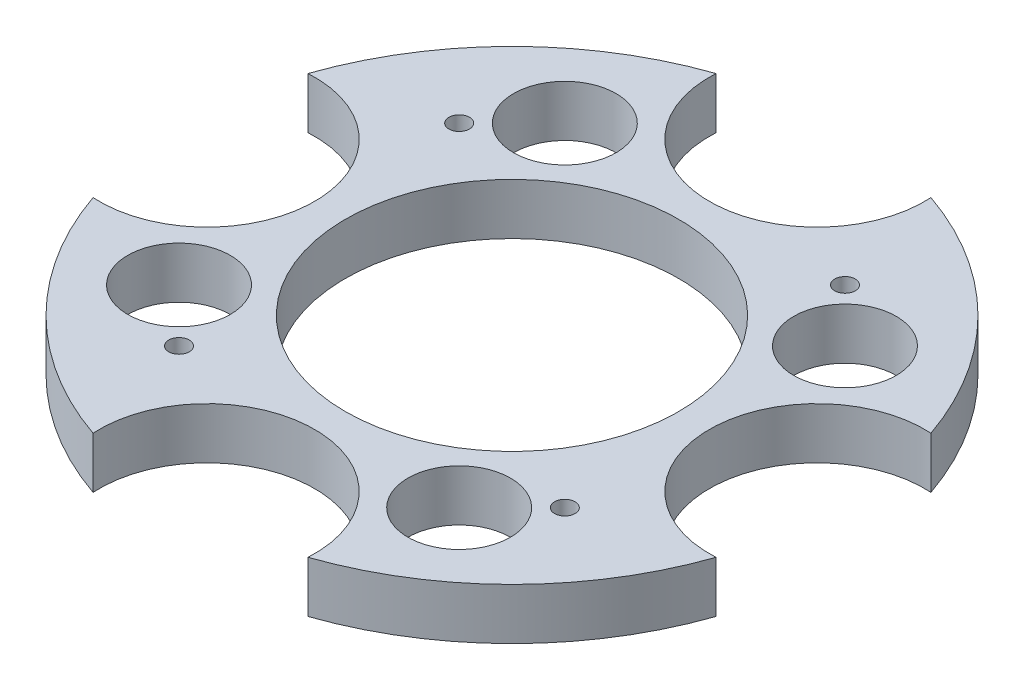
ISO-10303-21;
HEADER;
FILE_DESCRIPTION(('STEP AP214'),'2;1');
FILE_NAME('part.step','',(''),(''),'','','');
FILE_SCHEMA(('AUTOMOTIVE_DESIGN { 1 0 10303 214 1 1 1 1 }'));
ENDSEC;
DATA;
#1=APPLICATION_CONTEXT('core data for automotive mechanical design processes');
#2=APPLICATION_PROTOCOL_DEFINITION('international standard','automotive_design',2000,#1);
#3=PRODUCT_CONTEXT('',#1,'mechanical');
#4=PRODUCT('Part','Part','',(#3));
#5=PRODUCT_RELATED_PRODUCT_CATEGORY('part','',(#4));
#6=PRODUCT_DEFINITION_FORMATION('','',#4);
#7=PRODUCT_DEFINITION_CONTEXT('part definition',#1,'design');
#8=PRODUCT_DEFINITION('design','',#6,#7);
#9=PRODUCT_DEFINITION_SHAPE('','',#8);
#10=(LENGTH_UNIT() NAMED_UNIT(*) SI_UNIT(.MILLI.,.METRE.));
#11=(NAMED_UNIT(*) PLANE_ANGLE_UNIT() SI_UNIT($,.RADIAN.));
#12=(NAMED_UNIT(*) SI_UNIT($,.STERADIAN.) SOLID_ANGLE_UNIT());
#13=UNCERTAINTY_MEASURE_WITH_UNIT(LENGTH_MEASURE(1.E-05),#10,'distance_accuracy_value','');
#14=(GEOMETRIC_REPRESENTATION_CONTEXT(3) GLOBAL_UNCERTAINTY_ASSIGNED_CONTEXT((#13)) GLOBAL_UNIT_ASSIGNED_CONTEXT((#10,
#11,#12)) REPRESENTATION_CONTEXT('',''));
#15=CARTESIAN_POINT('',(0.,0.,0.));
#16=DIRECTION('',(0.,0.,1.));
#17=DIRECTION('',(1.,0.,0.));
#18=AXIS2_PLACEMENT_3D('',#15,#16,#17);
#19=CARTESIAN_POINT('',(0.,2.5,0.));
#20=DIRECTION('',(0.,1.,0.));
#21=DIRECTION('',(0.,0.,1.));
#22=AXIS2_PLACEMENT_3D('',#19,#20,#21);
#23=PLANE('',#22);
#24=CARTESIAN_POINT('',(18.8130252100839,2.5,-13.6613536095347));
#25=DIRECTION('',(0.,1.,0.));
#26=DIRECTION('',(-1.,0.,0.));
#27=AXIS2_PLACEMENT_3D('',#24,#25,#26);
#28=CIRCLE('',#27,5.);
#29=CARTESIAN_POINT('',(13.8130252100839,2.5,-13.6613536095347));
#30=VERTEX_POINT('',#29);
#31=EDGE_CURVE('E174',#30,#30,#28,.T.);
#32=ORIENTED_EDGE('',*,*,#31,.F.);
#33=EDGE_LOOP('',(#32));
#34=FACE_BOUND('',#33,.T.);
#35=CARTESIAN_POINT('',(-13.6613536095346,2.5,18.813025210084));
#36=DIRECTION('',(0.,1.,0.));
#37=DIRECTION('',(0.,0.,-1.));
#38=AXIS2_PLACEMENT_3D('',#35,#36,#37);
#39=CIRCLE('',#38,1.);
#40=CARTESIAN_POINT('',(-13.6613536095346,2.5,17.813025210084));
#41=VERTEX_POINT('',#40);
#42=EDGE_CURVE('E178',#41,#41,#39,.T.);
#43=ORIENTED_EDGE('',*,*,#42,.F.);
#44=EDGE_LOOP('',(#43));
#45=FACE_BOUND('',#44,.T.);
#46=CARTESIAN_POINT('',(13.6613536095345,2.5,18.813025210084));
#47=DIRECTION('',(0.,1.,0.));
#48=DIRECTION('',(0.,0.,-1.));
#49=AXIS2_PLACEMENT_3D('',#46,#47,#48);
#50=CIRCLE('',#49,5.);
#51=CARTESIAN_POINT('',(13.6613536095345,2.5,13.813025210084));
#52=VERTEX_POINT('',#51);
#53=EDGE_CURVE('E182',#52,#52,#50,.T.);
#54=ORIENTED_EDGE('',*,*,#53,.F.);
#55=EDGE_LOOP('',(#54));
#56=FACE_BOUND('',#55,.T.);
#57=CARTESIAN_POINT('',(-18.8130252100841,2.5,-13.6613536095345));
#58=DIRECTION('',(0.,1.,0.));
#59=DIRECTION('',(1.,0.,0.));
#60=AXIS2_PLACEMENT_3D('',#57,#58,#59);
#61=CIRCLE('',#60,1.);
#62=CARTESIAN_POINT('',(-17.8130252100841,2.5,-13.6613536095345));
#63=VERTEX_POINT('',#62);
#64=EDGE_CURVE('E186',#63,#63,#61,.T.);
#65=ORIENTED_EDGE('',*,*,#64,.F.);
#66=EDGE_LOOP('',(#65));
#67=FACE_BOUND('',#66,.T.);
#68=CARTESIAN_POINT('',(18.8130252100842,2.5,13.6613536095344));
#69=DIRECTION('',(0.,1.,0.));
#70=DIRECTION('',(-1.,0.,0.));
#71=AXIS2_PLACEMENT_3D('',#68,#69,#70);
#72=CIRCLE('',#71,1.);
#73=CARTESIAN_POINT('',(17.8130252100842,2.5,13.6613536095344));
#74=VERTEX_POINT('',#73);
#75=EDGE_CURVE('E190',#74,#74,#72,.T.);
#76=ORIENTED_EDGE('',*,*,#75,.F.);
#77=EDGE_LOOP('',(#76));
#78=FACE_BOUND('',#77,.T.);
#79=CARTESIAN_POINT('',(-18.813025210084,2.5,13.6613536095346));
#80=DIRECTION('',(0.,1.,0.));
#81=DIRECTION('',(1.,0.,0.));
#82=AXIS2_PLACEMENT_3D('',#79,#80,#81);
#83=CIRCLE('',#82,5.);
#84=CARTESIAN_POINT('',(-13.813025210084,2.5,13.6613536095346));
#85=VERTEX_POINT('',#84);
#86=EDGE_CURVE('E194',#85,#85,#83,.T.);
#87=ORIENTED_EDGE('',*,*,#86,.F.);
#88=EDGE_LOOP('',(#87));
#89=FACE_BOUND('',#88,.T.);
#90=CARTESIAN_POINT('',(-13.6613536095345,2.5,-18.813025210084));
#91=DIRECTION('',(0.,1.,0.));
#92=DIRECTION('',(0.,0.,1.));
#93=AXIS2_PLACEMENT_3D('',#90,#91,#92);
#94=CIRCLE('',#93,5.);
#95=CARTESIAN_POINT('',(-13.6613536095345,2.5,-13.813025210084));
#96=VERTEX_POINT('',#95);
#97=EDGE_CURVE('E198',#96,#96,#94,.T.);
#98=ORIENTED_EDGE('',*,*,#97,.F.);
#99=EDGE_LOOP('',(#98));
#100=FACE_BOUND('',#99,.T.);
#101=CARTESIAN_POINT('',(13.6613536095346,2.5,-18.813025210084));
#102=DIRECTION('',(0.,1.,0.));
#103=DIRECTION('',(0.,0.,1.));
#104=AXIS2_PLACEMENT_3D('',#101,#102,#103);
#105=CIRCLE('',#104,1.);
#106=CARTESIAN_POINT('',(13.6613536095346,2.5,-17.813025210084));
#107=VERTEX_POINT('',#106);
#108=EDGE_CURVE('E202',#107,#107,#105,.T.);
#109=ORIENTED_EDGE('',*,*,#108,.F.);
#110=EDGE_LOOP('',(#109));
#111=FACE_BOUND('',#110,.T.);
#112=CARTESIAN_POINT('',(0.,2.5,0.));
#113=DIRECTION('',(0.,1.,0.));
#114=DIRECTION('',(0.,0.,1.));
#115=AXIS2_PLACEMENT_3D('',#112,#113,#114);
#116=CIRCLE('',#115,16.25);
#117=CARTESIAN_POINT('',(0.,2.5,16.25));
#118=VERTEX_POINT('',#117);
#119=EDGE_CURVE('E141',#118,#118,#116,.T.);
#120=ORIENTED_EDGE('',*,*,#119,.F.);
#121=EDGE_LOOP('',(#120));
#122=FACE_BOUND('',#121,.T.);
#123=CARTESIAN_POINT('',(0.,2.5,29.75));
#124=DIRECTION('',(0.,1.,0.));
#125=DIRECTION('',(0.,0.,-1.));
#126=AXIS2_PLACEMENT_3D('',#123,#124,#125);
#127=CIRCLE('',#126,10.5);
#128=CARTESIAN_POINT('',(10.4812233958542,2.5,30.3776592436975));
#129=VERTEX_POINT('',#128);
#130=CARTESIAN_POINT('',(-10.4812233958542,2.5,30.3776592436975));
#131=VERTEX_POINT('',#130);
#132=EDGE_CURVE('E121',#129,#131,#127,.T.);
#133=ORIENTED_EDGE('',*,*,#132,.F.);
#134=CARTESIAN_POINT('',(0.,2.5,0.));
#135=DIRECTION('',(0.,1.,0.));
#136=DIRECTION('',(0.,0.,1.));
#137=AXIS2_PLACEMENT_3D('',#134,#135,#136);
#138=CIRCLE('',#137,32.135);
#139=CARTESIAN_POINT('',(30.3776592436976,2.5,10.4812233958539));
#140=VERTEX_POINT('',#139);
#141=EDGE_CURVE('E112',#129,#140,#138,.T.);
#142=ORIENTED_EDGE('',*,*,#141,.T.);
#143=CARTESIAN_POINT('',(29.75,2.5,-3.1161470949175E-13));
#144=DIRECTION('',(0.,1.,0.));
#145=DIRECTION('',(-1.,0.,0.));
#146=AXIS2_PLACEMENT_3D('',#143,#144,#145);
#147=CIRCLE('',#146,10.5);
#148=CARTESIAN_POINT('',(30.3776592436974,2.5,-10.4812233958545));
#149=VERTEX_POINT('',#148);
#150=EDGE_CURVE('E130',#149,#140,#147,.T.);
#151=ORIENTED_EDGE('',*,*,#150,.F.);
#152=CARTESIAN_POINT('',(10.4812233958542,2.5,-30.3776592436975));
#153=VERTEX_POINT('',#152);
#154=EDGE_CURVE('E42',#149,#153,#138,.T.);
#155=ORIENTED_EDGE('',*,*,#154,.T.);
#156=CARTESIAN_POINT('',(0.,2.5,-29.75));
#157=DIRECTION('',(0.,1.,0.));
#158=DIRECTION('',(0.,0.,1.));
#159=AXIS2_PLACEMENT_3D('',#156,#157,#158);
#160=CIRCLE('',#159,10.5);
#161=CARTESIAN_POINT('',(-10.4812233958542,2.5,-30.3776592436975));
#162=VERTEX_POINT('',#161);
#163=EDGE_CURVE('E138',#162,#153,#160,.T.);
#164=ORIENTED_EDGE('',*,*,#163,.F.);
#165=CARTESIAN_POINT('',(-30.3776592436975,2.5,-10.4812233958541));
#166=VERTEX_POINT('',#165);
#167=EDGE_CURVE('E11',#162,#166,#138,.T.);
#168=ORIENTED_EDGE('',*,*,#167,.T.);
#169=CARTESIAN_POINT('',(-29.75,2.5,1.03871569830583E-13));
#170=DIRECTION('',(0.,1.,0.));
#171=DIRECTION('',(1.,0.,0.));
#172=AXIS2_PLACEMENT_3D('',#169,#170,#171);
#173=CIRCLE('',#172,10.5);
#174=CARTESIAN_POINT('',(-30.3776592436975,2.5,10.4812233958543));
#175=VERTEX_POINT('',#174);
#176=EDGE_CURVE('E120',#175,#166,#173,.T.);
#177=ORIENTED_EDGE('',*,*,#176,.F.);
#178=EDGE_CURVE('E41',#175,#131,#138,.T.);
#179=ORIENTED_EDGE('',*,*,#178,.T.);
#180=EDGE_LOOP('',(#133,#142,#151,#155,#164,#168,#177,#179));
#181=FACE_BOUND('',#180,.T.);
#182=ADVANCED_FACE('F32',(#34,#45,#56,#67,#78,#89,#100,#111,#122,#181),#23,.T.);
#183=CARTESIAN_POINT('',(0.,-2.5,0.));
#184=DIRECTION('',(0.,1.,0.));
#185=DIRECTION('',(0.,0.,1.));
#186=AXIS2_PLACEMENT_3D('',#183,#184,#185);
#187=PLANE('',#186);
#188=CARTESIAN_POINT('',(18.8130252100839,-2.5,-13.6613536095347));
#189=DIRECTION('',(0.,1.,0.));
#190=DIRECTION('',(-1.,0.,0.));
#191=AXIS2_PLACEMENT_3D('',#188,#189,#190);
#192=CIRCLE('',#191,5.);
#193=CARTESIAN_POINT('',(13.8130252100839,-2.5,-13.6613536095347));
#194=VERTEX_POINT('',#193);
#195=EDGE_CURVE('E230',#194,#194,#192,.T.);
#196=ORIENTED_EDGE('',*,*,#195,.T.);
#197=EDGE_LOOP('',(#196));
#198=FACE_BOUND('',#197,.T.);
#199=CARTESIAN_POINT('',(-13.6613536095346,-2.5,18.813025210084));
#200=DIRECTION('',(0.,1.,0.));
#201=DIRECTION('',(0.,0.,-1.));
#202=AXIS2_PLACEMENT_3D('',#199,#200,#201);
#203=CIRCLE('',#202,1.);
#204=CARTESIAN_POINT('',(-13.6613536095346,-2.5,17.813025210084));
#205=VERTEX_POINT('',#204);
#206=EDGE_CURVE('E226',#205,#205,#203,.T.);
#207=ORIENTED_EDGE('',*,*,#206,.T.);
#208=EDGE_LOOP('',(#207));
#209=FACE_BOUND('',#208,.T.);
#210=CARTESIAN_POINT('',(13.6613536095345,-2.5,18.813025210084));
#211=DIRECTION('',(0.,1.,0.));
#212=DIRECTION('',(0.,0.,-1.));
#213=AXIS2_PLACEMENT_3D('',#210,#211,#212);
#214=CIRCLE('',#213,5.);
#215=CARTESIAN_POINT('',(13.6613536095345,-2.5,13.813025210084));
#216=VERTEX_POINT('',#215);
#217=EDGE_CURVE('E238',#216,#216,#214,.T.);
#218=ORIENTED_EDGE('',*,*,#217,.T.);
#219=EDGE_LOOP('',(#218));
#220=FACE_BOUND('',#219,.T.);
#221=CARTESIAN_POINT('',(-18.8130252100841,-2.5,-13.6613536095345));
#222=DIRECTION('',(0.,1.,0.));
#223=DIRECTION('',(1.,0.,0.));
#224=AXIS2_PLACEMENT_3D('',#221,#222,#223);
#225=CIRCLE('',#224,1.);
#226=CARTESIAN_POINT('',(-17.8130252100841,-2.5,-13.6613536095345));
#227=VERTEX_POINT('',#226);
#228=EDGE_CURVE('E234',#227,#227,#225,.T.);
#229=ORIENTED_EDGE('',*,*,#228,.T.);
#230=EDGE_LOOP('',(#229));
#231=FACE_BOUND('',#230,.T.);
#232=CARTESIAN_POINT('',(18.8130252100842,-2.5,13.6613536095344));
#233=DIRECTION('',(0.,1.,0.));
#234=DIRECTION('',(-1.,0.,0.));
#235=AXIS2_PLACEMENT_3D('',#232,#233,#234);
#236=CIRCLE('',#235,1.);
#237=CARTESIAN_POINT('',(17.8130252100842,-2.5,13.6613536095344));
#238=VERTEX_POINT('',#237);
#239=EDGE_CURVE('E222',#238,#238,#236,.T.);
#240=ORIENTED_EDGE('',*,*,#239,.T.);
#241=EDGE_LOOP('',(#240));
#242=FACE_BOUND('',#241,.T.);
#243=CARTESIAN_POINT('',(-18.813025210084,-2.5,13.6613536095346));
#244=DIRECTION('',(0.,1.,0.));
#245=DIRECTION('',(1.,0.,0.));
#246=AXIS2_PLACEMENT_3D('',#243,#244,#245);
#247=CIRCLE('',#246,5.);
#248=CARTESIAN_POINT('',(-13.813025210084,-2.5,13.6613536095346));
#249=VERTEX_POINT('',#248);
#250=EDGE_CURVE('E242',#249,#249,#247,.T.);
#251=ORIENTED_EDGE('',*,*,#250,.T.);
#252=EDGE_LOOP('',(#251));
#253=FACE_BOUND('',#252,.T.);
#254=CARTESIAN_POINT('',(-13.6613536095345,-2.5,-18.813025210084));
#255=DIRECTION('',(0.,1.,0.));
#256=DIRECTION('',(0.,0.,1.));
#257=AXIS2_PLACEMENT_3D('',#254,#255,#256);
#258=CIRCLE('',#257,5.);
#259=CARTESIAN_POINT('',(-13.6613536095345,-2.5,-13.813025210084));
#260=VERTEX_POINT('',#259);
#261=EDGE_CURVE('E133',#260,#260,#258,.T.);
#262=ORIENTED_EDGE('',*,*,#261,.T.);
#263=EDGE_LOOP('',(#262));
#264=FACE_BOUND('',#263,.T.);
#265=CARTESIAN_POINT('',(13.6613536095346,-2.5,-18.813025210084));
#266=DIRECTION('',(0.,1.,0.));
#267=DIRECTION('',(0.,0.,1.));
#268=AXIS2_PLACEMENT_3D('',#265,#266,#267);
#269=CIRCLE('',#268,1.);
#270=CARTESIAN_POINT('',(13.6613536095346,-2.5,-17.813025210084));
#271=VERTEX_POINT('',#270);
#272=EDGE_CURVE('E249',#271,#271,#269,.T.);
#273=ORIENTED_EDGE('',*,*,#272,.T.);
#274=EDGE_LOOP('',(#273));
#275=FACE_BOUND('',#274,.T.);
#276=CARTESIAN_POINT('',(0.,-2.5,0.));
#277=DIRECTION('',(0.,1.,0.));
#278=DIRECTION('',(0.,0.,1.));
#279=AXIS2_PLACEMENT_3D('',#276,#277,#278);
#280=CIRCLE('',#279,16.25);
#281=CARTESIAN_POINT('',(0.,-2.5,16.25));
#282=VERTEX_POINT('',#281);
#283=EDGE_CURVE('E137',#282,#282,#280,.T.);
#284=ORIENTED_EDGE('',*,*,#283,.T.);
#285=EDGE_LOOP('',(#284));
#286=FACE_BOUND('',#285,.T.);
#287=CARTESIAN_POINT('',(0.,-2.5,0.));
#288=DIRECTION('',(0.,1.,0.));
#289=DIRECTION('',(0.,0.,1.));
#290=AXIS2_PLACEMENT_3D('',#287,#288,#289);
#291=CIRCLE('',#290,32.135);
#292=CARTESIAN_POINT('',(10.4812233958542,-2.5,30.3776592436975));
#293=VERTEX_POINT('',#292);
#294=CARTESIAN_POINT('',(30.3776592436976,-2.5,10.4812233958539));
#295=VERTEX_POINT('',#294);
#296=EDGE_CURVE('E97',#293,#295,#291,.T.);
#297=ORIENTED_EDGE('',*,*,#296,.F.);
#298=CARTESIAN_POINT('',(0.,-2.5,29.75));
#299=DIRECTION('',(0.,1.,0.));
#300=DIRECTION('',(0.,0.,-1.));
#301=AXIS2_PLACEMENT_3D('',#298,#299,#300);
#302=CIRCLE('',#301,10.5);
#303=CARTESIAN_POINT('',(-10.4812233958542,-2.5,30.3776592436975));
#304=VERTEX_POINT('',#303);
#305=EDGE_CURVE('E101',#293,#304,#302,.T.);
#306=ORIENTED_EDGE('',*,*,#305,.T.);
#307=CARTESIAN_POINT('',(-30.3776592436975,-2.5,10.4812233958543));
#308=VERTEX_POINT('',#307);
#309=EDGE_CURVE('E107',#308,#304,#291,.T.);
#310=ORIENTED_EDGE('',*,*,#309,.F.);
#311=CARTESIAN_POINT('',(-29.75,-2.5,1.03871569830583E-13));
#312=DIRECTION('',(0.,1.,0.));
#313=DIRECTION('',(1.,0.,0.));
#314=AXIS2_PLACEMENT_3D('',#311,#312,#313);
#315=CIRCLE('',#314,10.5);
#316=CARTESIAN_POINT('',(-30.3776592436975,-2.5,-10.4812233958541));
#317=VERTEX_POINT('',#316);
#318=EDGE_CURVE('E124',#308,#317,#315,.T.);
#319=ORIENTED_EDGE('',*,*,#318,.T.);
#320=CARTESIAN_POINT('',(-10.4812233958542,-2.5,-30.3776592436975));
#321=VERTEX_POINT('',#320);
#322=EDGE_CURVE('E36',#321,#317,#291,.T.);
#323=ORIENTED_EDGE('',*,*,#322,.F.);
#324=CARTESIAN_POINT('',(0.,-2.5,-29.75));
#325=DIRECTION('',(0.,1.,0.));
#326=DIRECTION('',(0.,0.,1.));
#327=AXIS2_PLACEMENT_3D('',#324,#325,#326);
#328=CIRCLE('',#327,10.5);
#329=CARTESIAN_POINT('',(10.4812233958542,-2.5,-30.3776592436975));
#330=VERTEX_POINT('',#329);
#331=EDGE_CURVE('E134',#321,#330,#328,.T.);
#332=ORIENTED_EDGE('',*,*,#331,.T.);
#333=CARTESIAN_POINT('',(30.3776592436974,-2.5,-10.4812233958545));
#334=VERTEX_POINT('',#333);
#335=EDGE_CURVE('E108',#334,#330,#291,.T.);
#336=ORIENTED_EDGE('',*,*,#335,.F.);
#337=CARTESIAN_POINT('',(29.75,-2.5,-3.1161470949175E-13));
#338=DIRECTION('',(0.,1.,0.));
#339=DIRECTION('',(-1.,0.,0.));
#340=AXIS2_PLACEMENT_3D('',#337,#338,#339);
#341=CIRCLE('',#340,10.5);
#342=EDGE_CURVE('E103',#334,#295,#341,.T.);
#343=ORIENTED_EDGE('',*,*,#342,.T.);
#344=EDGE_LOOP('',(#297,#306,#310,#319,#323,#332,#336,#343));
#345=FACE_BOUND('',#344,.T.);
#346=ADVANCED_FACE('F99',(#198,#209,#220,#231,#242,#253,#264,#275,#286,#345),#187,.F.);
#347=CARTESIAN_POINT('',(0.,-2.5,-29.75));
#348=DIRECTION('',(0.,1.,0.));
#349=DIRECTION('',(0.,0.,1.));
#350=AXIS2_PLACEMENT_3D('',#347,#348,#349);
#351=CYLINDRICAL_SURFACE('',#350,10.5);
#352=DIRECTION('',(0.,1.,0.));
#353=VECTOR('',#352,1.);
#354=CARTESIAN_POINT('',(10.4812233958542,0.,-30.3776592436975));
#355=LINE('',#354,#353);
#356=EDGE_CURVE('E219',#330,#153,#355,.T.);
#357=ORIENTED_EDGE('',*,*,#356,.F.);
#358=ORIENTED_EDGE('',*,*,#331,.F.);
#359=DIRECTION('',(0.,1.,0.));
#360=VECTOR('',#359,1.);
#361=CARTESIAN_POINT('',(-10.4812233958542,0.,-30.3776592436975));
#362=LINE('',#361,#360);
#363=EDGE_CURVE('E207',#162,#321,#362,.F.);
#364=ORIENTED_EDGE('',*,*,#363,.F.);
#365=ORIENTED_EDGE('',*,*,#163,.T.);
#366=EDGE_LOOP('',(#357,#358,#364,#365));
#367=FACE_BOUND('',#366,.T.);
#368=ADVANCED_FACE('F169',(#367),#351,.F.);
#369=CARTESIAN_POINT('',(29.75,-2.5,-3.1161470949175E-13));
#370=DIRECTION('',(0.,1.,0.));
#371=DIRECTION('',(0.,0.,1.));
#372=AXIS2_PLACEMENT_3D('',#369,#370,#371);
#373=CYLINDRICAL_SURFACE('',#372,10.5);
#374=DIRECTION('',(0.,1.,0.));
#375=VECTOR('',#374,1.);
#376=CARTESIAN_POINT('',(30.3776592436976,0.,10.4812233958539));
#377=LINE('',#376,#375);
#378=EDGE_CURVE('E205',#295,#140,#377,.T.);
#379=ORIENTED_EDGE('',*,*,#378,.F.);
#380=ORIENTED_EDGE('',*,*,#342,.F.);
#381=DIRECTION('',(0.,1.,0.));
#382=VECTOR('',#381,1.);
#383=CARTESIAN_POINT('',(30.3776592436974,0.,-10.4812233958545));
#384=LINE('',#383,#382);
#385=EDGE_CURVE('E208',#149,#334,#384,.F.);
#386=ORIENTED_EDGE('',*,*,#385,.F.);
#387=ORIENTED_EDGE('',*,*,#150,.T.);
#388=EDGE_LOOP('',(#379,#380,#386,#387));
#389=FACE_BOUND('',#388,.T.);
#390=ADVANCED_FACE('F211',(#389),#373,.F.);
#391=CARTESIAN_POINT('',(0.,-2.5,29.75));
#392=DIRECTION('',(0.,1.,0.));
#393=DIRECTION('',(0.,0.,1.));
#394=AXIS2_PLACEMENT_3D('',#391,#392,#393);
#395=CYLINDRICAL_SURFACE('',#394,10.5);
#396=DIRECTION('',(0.,1.,0.));
#397=VECTOR('',#396,1.);
#398=CARTESIAN_POINT('',(-10.4812233958542,0.,30.3776592436975));
#399=LINE('',#398,#397);
#400=EDGE_CURVE('E115',#304,#131,#399,.T.);
#401=ORIENTED_EDGE('',*,*,#400,.F.);
#402=ORIENTED_EDGE('',*,*,#305,.F.);
#403=DIRECTION('',(0.,1.,0.));
#404=VECTOR('',#403,1.);
#405=CARTESIAN_POINT('',(10.4812233958542,0.,30.3776592436975));
#406=LINE('',#405,#404);
#407=EDGE_CURVE('E110',#129,#293,#406,.F.);
#408=ORIENTED_EDGE('',*,*,#407,.F.);
#409=ORIENTED_EDGE('',*,*,#132,.T.);
#410=EDGE_LOOP('',(#401,#402,#408,#409));
#411=FACE_BOUND('',#410,.T.);
#412=ADVANCED_FACE('F119',(#411),#395,.F.);
#413=CARTESIAN_POINT('',(-29.75,-2.5,1.03871569830583E-13));
#414=DIRECTION('',(0.,1.,0.));
#415=DIRECTION('',(0.,0.,1.));
#416=AXIS2_PLACEMENT_3D('',#413,#414,#415);
#417=CYLINDRICAL_SURFACE('',#416,10.5);
#418=DIRECTION('',(0.,1.,0.));
#419=VECTOR('',#418,1.);
#420=CARTESIAN_POINT('',(-30.3776592436975,0.,-10.4812233958541));
#421=LINE('',#420,#419);
#422=EDGE_CURVE('E116',#317,#166,#421,.T.);
#423=ORIENTED_EDGE('',*,*,#422,.F.);
#424=ORIENTED_EDGE('',*,*,#318,.F.);
#425=DIRECTION('',(0.,1.,0.));
#426=VECTOR('',#425,1.);
#427=CARTESIAN_POINT('',(-30.3776592436975,0.,10.4812233958543));
#428=LINE('',#427,#426);
#429=EDGE_CURVE('E257',#175,#308,#428,.F.);
#430=ORIENTED_EDGE('',*,*,#429,.F.);
#431=ORIENTED_EDGE('',*,*,#176,.T.);
#432=EDGE_LOOP('',(#423,#424,#430,#431));
#433=FACE_BOUND('',#432,.T.);
#434=ADVANCED_FACE('F256',(#433),#417,.F.);
#435=CARTESIAN_POINT('',(0.,2.5,0.));
#436=DIRECTION('',(0.,-1.,0.));
#437=DIRECTION('',(0.,0.,-1.));
#438=AXIS2_PLACEMENT_3D('',#435,#436,#437);
#439=CYLINDRICAL_SURFACE('',#438,32.135);
#440=ORIENTED_EDGE('',*,*,#178,.F.);
#441=ORIENTED_EDGE('',*,*,#429,.T.);
#442=ORIENTED_EDGE('',*,*,#309,.T.);
#443=ORIENTED_EDGE('',*,*,#400,.T.);
#444=EDGE_LOOP('',(#440,#441,#442,#443));
#445=FACE_BOUND('',#444,.T.);
#446=ADVANCED_FACE('F261',(#445),#439,.T.);
#447=ORIENTED_EDGE('',*,*,#141,.F.);
#448=ORIENTED_EDGE('',*,*,#407,.T.);
#449=ORIENTED_EDGE('',*,*,#296,.T.);
#450=ORIENTED_EDGE('',*,*,#378,.T.);
#451=EDGE_LOOP('',(#447,#448,#449,#450));
#452=FACE_BOUND('',#451,.T.);
#453=ADVANCED_FACE('F111',(#452),#439,.T.);
#454=ORIENTED_EDGE('',*,*,#154,.F.);
#455=ORIENTED_EDGE('',*,*,#385,.T.);
#456=ORIENTED_EDGE('',*,*,#335,.T.);
#457=ORIENTED_EDGE('',*,*,#356,.T.);
#458=EDGE_LOOP('',(#454,#455,#456,#457));
#459=FACE_BOUND('',#458,.T.);
#460=ADVANCED_FACE('F34',(#459),#439,.T.);
#461=ORIENTED_EDGE('',*,*,#322,.T.);
#462=ORIENTED_EDGE('',*,*,#422,.T.);
#463=ORIENTED_EDGE('',*,*,#167,.F.);
#464=ORIENTED_EDGE('',*,*,#363,.T.);
#465=EDGE_LOOP('',(#461,#462,#463,#464));
#466=FACE_BOUND('',#465,.T.);
#467=ADVANCED_FACE('F151',(#466),#439,.T.);
#468=CARTESIAN_POINT('',(0.,2.5,0.));
#469=DIRECTION('',(0.,-1.,0.));
#470=DIRECTION('',(0.,0.,-1.));
#471=AXIS2_PLACEMENT_3D('',#468,#469,#470);
#472=CYLINDRICAL_SURFACE('',#471,16.25);
#473=ORIENTED_EDGE('',*,*,#119,.T.);
#474=EDGE_LOOP('',(#473));
#475=FACE_BOUND('',#474,.T.);
#476=ORIENTED_EDGE('',*,*,#283,.F.);
#477=EDGE_LOOP('',(#476));
#478=FACE_BOUND('',#477,.T.);
#479=ADVANCED_FACE('F148',(#475,#478),#472,.F.);
#480=CARTESIAN_POINT('',(13.6613536095346,-2.5,-18.813025210084));
#481=DIRECTION('',(0.,1.,0.));
#482=DIRECTION('',(0.,0.,1.));
#483=AXIS2_PLACEMENT_3D('',#480,#481,#482);
#484=CYLINDRICAL_SURFACE('',#483,1.);
#485=ORIENTED_EDGE('',*,*,#272,.F.);
#486=EDGE_LOOP('',(#485));
#487=FACE_BOUND('',#486,.T.);
#488=ORIENTED_EDGE('',*,*,#108,.T.);
#489=EDGE_LOOP('',(#488));
#490=FACE_BOUND('',#489,.T.);
#491=ADVANCED_FACE('F150',(#487,#490),#484,.F.);
#492=CARTESIAN_POINT('',(-13.6613536095345,-2.5,-18.813025210084));
#493=DIRECTION('',(0.,1.,0.));
#494=DIRECTION('',(0.,0.,1.));
#495=AXIS2_PLACEMENT_3D('',#492,#493,#494);
#496=CYLINDRICAL_SURFACE('',#495,5.);
#497=ORIENTED_EDGE('',*,*,#261,.F.);
#498=EDGE_LOOP('',(#497));
#499=FACE_BOUND('',#498,.T.);
#500=ORIENTED_EDGE('',*,*,#97,.T.);
#501=EDGE_LOOP('',(#500));
#502=FACE_BOUND('',#501,.T.);
#503=ADVANCED_FACE('F158',(#499,#502),#496,.F.);
#504=CARTESIAN_POINT('',(-18.813025210084,-2.5,13.6613536095346));
#505=DIRECTION('',(0.,1.,0.));
#506=DIRECTION('',(0.,0.,1.));
#507=AXIS2_PLACEMENT_3D('',#504,#505,#506);
#508=CYLINDRICAL_SURFACE('',#507,5.);
#509=ORIENTED_EDGE('',*,*,#250,.F.);
#510=EDGE_LOOP('',(#509));
#511=FACE_BOUND('',#510,.T.);
#512=ORIENTED_EDGE('',*,*,#86,.T.);
#513=EDGE_LOOP('',(#512));
#514=FACE_BOUND('',#513,.T.);
#515=ADVANCED_FACE('F279',(#511,#514),#508,.F.);
#516=CARTESIAN_POINT('',(18.8130252100842,-2.5,13.6613536095344));
#517=DIRECTION('',(0.,1.,0.));
#518=DIRECTION('',(0.,0.,1.));
#519=AXIS2_PLACEMENT_3D('',#516,#517,#518);
#520=CYLINDRICAL_SURFACE('',#519,1.);
#521=ORIENTED_EDGE('',*,*,#239,.F.);
#522=EDGE_LOOP('',(#521));
#523=FACE_BOUND('',#522,.T.);
#524=ORIENTED_EDGE('',*,*,#75,.T.);
#525=EDGE_LOOP('',(#524));
#526=FACE_BOUND('',#525,.T.);
#527=ADVANCED_FACE('F283',(#523,#526),#520,.F.);
#528=CARTESIAN_POINT('',(-18.8130252100841,-2.5,-13.6613536095345));
#529=DIRECTION('',(0.,1.,0.));
#530=DIRECTION('',(0.,0.,1.));
#531=AXIS2_PLACEMENT_3D('',#528,#529,#530);
#532=CYLINDRICAL_SURFACE('',#531,1.);
#533=ORIENTED_EDGE('',*,*,#228,.F.);
#534=EDGE_LOOP('',(#533));
#535=FACE_BOUND('',#534,.T.);
#536=ORIENTED_EDGE('',*,*,#64,.T.);
#537=EDGE_LOOP('',(#536));
#538=FACE_BOUND('',#537,.T.);
#539=ADVANCED_FACE('F289',(#535,#538),#532,.F.);
#540=CARTESIAN_POINT('',(13.6613536095345,-2.5,18.813025210084));
#541=DIRECTION('',(0.,1.,0.));
#542=DIRECTION('',(0.,0.,1.));
#543=AXIS2_PLACEMENT_3D('',#540,#541,#542);
#544=CYLINDRICAL_SURFACE('',#543,5.);
#545=ORIENTED_EDGE('',*,*,#217,.F.);
#546=EDGE_LOOP('',(#545));
#547=FACE_BOUND('',#546,.T.);
#548=ORIENTED_EDGE('',*,*,#53,.T.);
#549=EDGE_LOOP('',(#548));
#550=FACE_BOUND('',#549,.T.);
#551=ADVANCED_FACE('F285',(#547,#550),#544,.F.);
#552=CARTESIAN_POINT('',(-13.6613536095346,-2.5,18.813025210084));
#553=DIRECTION('',(0.,1.,0.));
#554=DIRECTION('',(0.,0.,1.));
#555=AXIS2_PLACEMENT_3D('',#552,#553,#554);
#556=CYLINDRICAL_SURFACE('',#555,1.);
#557=ORIENTED_EDGE('',*,*,#206,.F.);
#558=EDGE_LOOP('',(#557));
#559=FACE_BOUND('',#558,.T.);
#560=ORIENTED_EDGE('',*,*,#42,.T.);
#561=EDGE_LOOP('',(#560));
#562=FACE_BOUND('',#561,.T.);
#563=ADVANCED_FACE('F288',(#559,#562),#556,.F.);
#564=CARTESIAN_POINT('',(18.8130252100839,-2.5,-13.6613536095347));
#565=DIRECTION('',(0.,1.,0.));
#566=DIRECTION('',(0.,0.,1.));
#567=AXIS2_PLACEMENT_3D('',#564,#565,#566);
#568=CYLINDRICAL_SURFACE('',#567,5.);
#569=ORIENTED_EDGE('',*,*,#195,.F.);
#570=EDGE_LOOP('',(#569));
#571=FACE_BOUND('',#570,.T.);
#572=ORIENTED_EDGE('',*,*,#31,.T.);
#573=EDGE_LOOP('',(#572));
#574=FACE_BOUND('',#573,.T.);
#575=ADVANCED_FACE('F294',(#571,#574),#568,.F.);
#576=CLOSED_SHELL('',(#182,#346,#368,#390,#412,#434,#446,#453,#460,#467,#479,#491,#503,#515,
#527,#539,#551,#563,#575));
#577=MANIFOLD_SOLID_BREP('B2',#576);
#578=ADVANCED_BREP_SHAPE_REPRESENTATION('',(#18,#577),#14);
#579=SHAPE_DEFINITION_REPRESENTATION(#9,#578);
ENDSEC;
END-ISO-10303-21;
